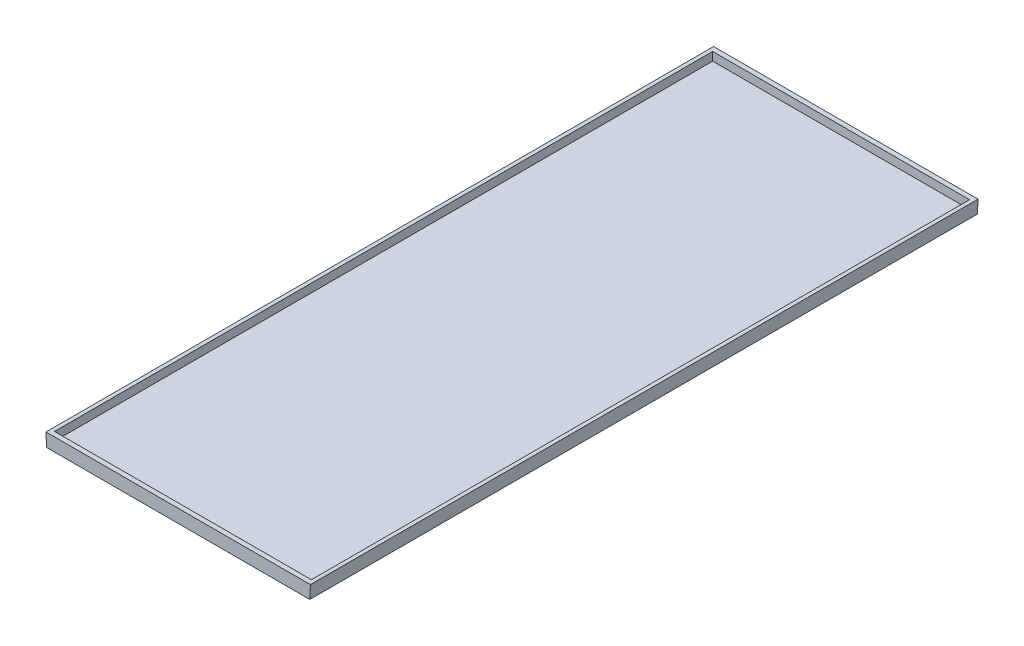
ISO-10303-21;
HEADER;
FILE_DESCRIPTION(('STEP AP214'),'2;1');
FILE_NAME('part.step','',(''),(''),'','','');
FILE_SCHEMA(('AUTOMOTIVE_DESIGN { 1 0 10303 214 1 1 1 1 }'));
ENDSEC;
DATA;
#1=APPLICATION_CONTEXT('core data for automotive mechanical design processes');
#2=APPLICATION_PROTOCOL_DEFINITION('international standard','automotive_design',2000,#1);
#3=PRODUCT_CONTEXT('',#1,'mechanical');
#4=PRODUCT('Part','Part','',(#3));
#5=PRODUCT_RELATED_PRODUCT_CATEGORY('part','',(#4));
#6=PRODUCT_DEFINITION_FORMATION('','',#4);
#7=PRODUCT_DEFINITION_CONTEXT('part definition',#1,'design');
#8=PRODUCT_DEFINITION('design','',#6,#7);
#9=PRODUCT_DEFINITION_SHAPE('','',#8);
#10=(LENGTH_UNIT() NAMED_UNIT(*) SI_UNIT(.MILLI.,.METRE.));
#11=(NAMED_UNIT(*) PLANE_ANGLE_UNIT() SI_UNIT($,.RADIAN.));
#12=(NAMED_UNIT(*) SI_UNIT($,.STERADIAN.) SOLID_ANGLE_UNIT());
#13=UNCERTAINTY_MEASURE_WITH_UNIT(LENGTH_MEASURE(1.E-05),#10,'distance_accuracy_value','');
#14=(GEOMETRIC_REPRESENTATION_CONTEXT(3) GLOBAL_UNCERTAINTY_ASSIGNED_CONTEXT((#13)) GLOBAL_UNIT_ASSIGNED_CONTEXT((#10,
#11,#12)) REPRESENTATION_CONTEXT('',''));
#15=CARTESIAN_POINT('',(0.,0.,0.));
#16=DIRECTION('',(0.,0.,1.));
#17=DIRECTION('',(1.,0.,0.));
#18=AXIS2_PLACEMENT_3D('',#15,#16,#17);
#19=CARTESIAN_POINT('',(-70.,-7.00000000000001,355.));
#20=DIRECTION('',(0.99908289581767,0.042817838392185,0.));
#21=DIRECTION('',(-0.042817838392185,0.99908289581767,0.));
#22=AXIS2_PLACEMENT_3D('',#19,#20,#21);
#23=PLANE('',#22);
#24=DIRECTION('',(0.042817838392185,-0.99908289581767,0.));
#25=VECTOR('',#24,1.);
#26=CARTESIAN_POINT('',(-70.,-7.00000000000001,0.));
#27=LINE('',#26,#25);
#28=CARTESIAN_POINT('',(-70.3,0.,0.));
#29=VERTEX_POINT('',#28);
#30=CARTESIAN_POINT('',(-70.,-7.00000000000001,0.));
#31=VERTEX_POINT('',#30);
#32=EDGE_CURVE('E148',#29,#31,#27,.T.);
#33=ORIENTED_EDGE('',*,*,#32,.T.);
#34=DIRECTION('',(0.,0.,-1.));
#35=VECTOR('',#34,1.);
#36=CARTESIAN_POINT('',(-70.,-7.00000000000001,355.));
#37=LINE('',#36,#35);
#38=CARTESIAN_POINT('',(-70.,-7.00000000000001,355.));
#39=VERTEX_POINT('',#38);
#40=EDGE_CURVE('E11',#39,#31,#37,.T.);
#41=ORIENTED_EDGE('',*,*,#40,.F.);
#42=DIRECTION('',(0.042817838392185,-0.99908289581767,0.));
#43=VECTOR('',#42,1.);
#44=CARTESIAN_POINT('',(-70.,-7.00000000000001,355.));
#45=LINE('',#44,#43);
#46=CARTESIAN_POINT('',(-70.3,0.,355.));
#47=VERTEX_POINT('',#46);
#48=EDGE_CURVE('E152',#47,#39,#45,.T.);
#49=ORIENTED_EDGE('',*,*,#48,.F.);
#50=DIRECTION('',(0.,0.,-1.));
#51=VECTOR('',#50,1.);
#52=CARTESIAN_POINT('',(-70.3,0.,355.));
#53=LINE('',#52,#51);
#54=EDGE_CURVE('E158',#47,#29,#53,.T.);
#55=ORIENTED_EDGE('',*,*,#54,.T.);
#56=EDGE_LOOP('',(#33,#41,#49,#55));
#57=FACE_BOUND('',#56,.T.);
#58=ADVANCED_FACE('F41',(#57),#23,.F.);
#59=CARTESIAN_POINT('',(-70.,-7.00000000000001,355.));
#60=DIRECTION('',(0.,1.,0.));
#61=DIRECTION('',(0.,0.,1.));
#62=AXIS2_PLACEMENT_3D('',#59,#60,#61);
#63=PLANE('',#62);
#64=DIRECTION('',(1.,0.,0.));
#65=VECTOR('',#64,1.);
#66=CARTESIAN_POINT('',(-70.,-7.00000000000001,0.));
#67=LINE('',#66,#65);
#68=CARTESIAN_POINT('',(70.,-7.00000000000001,0.));
#69=VERTEX_POINT('',#68);
#70=EDGE_CURVE('E161',#31,#69,#67,.T.);
#71=ORIENTED_EDGE('',*,*,#70,.T.);
#72=DIRECTION('',(0.,0.,-1.));
#73=VECTOR('',#72,1.);
#74=CARTESIAN_POINT('',(70.,-7.00000000000001,355.));
#75=LINE('',#74,#73);
#76=CARTESIAN_POINT('',(70.,-7.00000000000001,355.));
#77=VERTEX_POINT('',#76);
#78=EDGE_CURVE('E48',#77,#69,#75,.T.);
#79=ORIENTED_EDGE('',*,*,#78,.F.);
#80=DIRECTION('',(1.,0.,0.));
#81=VECTOR('',#80,1.);
#82=CARTESIAN_POINT('',(-70.,-7.00000000000001,355.));
#83=LINE('',#82,#81);
#84=EDGE_CURVE('E92',#39,#77,#83,.T.);
#85=ORIENTED_EDGE('',*,*,#84,.F.);
#86=ORIENTED_EDGE('',*,*,#40,.T.);
#87=EDGE_LOOP('',(#71,#79,#85,#86));
#88=FACE_BOUND('',#87,.T.);
#89=ADVANCED_FACE('F190',(#88),#63,.F.);
#90=CARTESIAN_POINT('',(70.,-7.00000000000001,355.));
#91=DIRECTION('',(-0.99908289581767,0.042817838392185,0.));
#92=DIRECTION('',(-0.042817838392185,-0.99908289581767,0.));
#93=AXIS2_PLACEMENT_3D('',#90,#91,#92);
#94=PLANE('',#93);
#95=DIRECTION('',(0.042817838392185,0.99908289581767,0.));
#96=VECTOR('',#95,1.);
#97=CARTESIAN_POINT('',(70.,-7.00000000000001,0.));
#98=LINE('',#97,#96);
#99=CARTESIAN_POINT('',(70.3,0.,0.));
#100=VERTEX_POINT('',#99);
#101=EDGE_CURVE('E163',#69,#100,#98,.T.);
#102=ORIENTED_EDGE('',*,*,#101,.T.);
#103=DIRECTION('',(0.,0.,-1.));
#104=VECTOR('',#103,1.);
#105=CARTESIAN_POINT('',(70.3,0.,355.));
#106=LINE('',#105,#104);
#107=CARTESIAN_POINT('',(70.3,0.,355.));
#108=VERTEX_POINT('',#107);
#109=EDGE_CURVE('E167',#108,#100,#106,.T.);
#110=ORIENTED_EDGE('',*,*,#109,.F.);
#111=DIRECTION('',(0.042817838392185,0.99908289581767,0.));
#112=VECTOR('',#111,1.);
#113=CARTESIAN_POINT('',(70.,-7.00000000000001,355.));
#114=LINE('',#113,#112);
#115=EDGE_CURVE('E155',#77,#108,#114,.T.);
#116=ORIENTED_EDGE('',*,*,#115,.F.);
#117=ORIENTED_EDGE('',*,*,#78,.T.);
#118=EDGE_LOOP('',(#102,#110,#116,#117));
#119=FACE_BOUND('',#118,.T.);
#120=ADVANCED_FACE('F172',(#119),#94,.F.);
#121=CARTESIAN_POINT('',(70.3,0.,355.));
#122=DIRECTION('',(0.,-1.,0.));
#123=DIRECTION('',(0.,0.,-1.));
#124=AXIS2_PLACEMENT_3D('',#121,#122,#123);
#125=PLANE('',#124);
#126=DIRECTION('',(0.,0.,-1.));
#127=VECTOR('',#126,1.);
#128=CARTESIAN_POINT('',(68.3,0.,0.));
#129=LINE('',#128,#127);
#130=CARTESIAN_POINT('',(68.3,0.,352.5));
#131=VERTEX_POINT('',#130);
#132=CARTESIAN_POINT('',(68.3,0.,2.5));
#133=VERTEX_POINT('',#132);
#134=EDGE_CURVE('E142',#131,#133,#129,.T.);
#135=ORIENTED_EDGE('',*,*,#134,.F.);
#136=DIRECTION('',(1.,0.,0.));
#137=VECTOR('',#136,1.);
#138=CARTESIAN_POINT('',(0.,0.,352.5));
#139=LINE('',#138,#137);
#140=CARTESIAN_POINT('',(-68.3,0.,352.5));
#141=VERTEX_POINT('',#140);
#142=EDGE_CURVE('E55',#141,#131,#139,.T.);
#143=ORIENTED_EDGE('',*,*,#142,.F.);
#144=DIRECTION('',(0.,0.,-1.));
#145=VECTOR('',#144,1.);
#146=CARTESIAN_POINT('',(-68.3,0.,0.));
#147=LINE('',#146,#145);
#148=CARTESIAN_POINT('',(-68.3,0.,2.5));
#149=VERTEX_POINT('',#148);
#150=EDGE_CURVE('E133',#141,#149,#147,.T.);
#151=ORIENTED_EDGE('',*,*,#150,.T.);
#152=DIRECTION('',(1.,0.,0.));
#153=VECTOR('',#152,1.);
#154=CARTESIAN_POINT('',(0.,0.,2.5));
#155=LINE('',#154,#153);
#156=EDGE_CURVE('E136',#149,#133,#155,.T.);
#157=ORIENTED_EDGE('',*,*,#156,.T.);
#158=EDGE_LOOP('',(#135,#143,#151,#157));
#159=FACE_BOUND('',#158,.T.);
#160=DIRECTION('',(-1.,0.,0.));
#161=VECTOR('',#160,1.);
#162=CARTESIAN_POINT('',(70.3,0.,0.));
#163=LINE('',#162,#161);
#164=EDGE_CURVE('E85',#100,#29,#163,.T.);
#165=ORIENTED_EDGE('',*,*,#164,.T.);
#166=ORIENTED_EDGE('',*,*,#54,.F.);
#167=DIRECTION('',(-1.,0.,0.));
#168=VECTOR('',#167,1.);
#169=CARTESIAN_POINT('',(70.3,0.,355.));
#170=LINE('',#169,#168);
#171=EDGE_CURVE('E64',#108,#47,#170,.T.);
#172=ORIENTED_EDGE('',*,*,#171,.F.);
#173=ORIENTED_EDGE('',*,*,#109,.T.);
#174=EDGE_LOOP('',(#165,#166,#172,#173));
#175=FACE_BOUND('',#174,.T.);
#176=ADVANCED_FACE('F180',(#159,#175),#125,.F.);
#177=CARTESIAN_POINT('',(0.,0.,355.));
#178=DIRECTION('',(0.,0.,1.));
#179=DIRECTION('',(1.,0.,0.));
#180=AXIS2_PLACEMENT_3D('',#177,#178,#179);
#181=PLANE('',#180);
#182=ORIENTED_EDGE('',*,*,#48,.T.);
#183=ORIENTED_EDGE('',*,*,#84,.T.);
#184=ORIENTED_EDGE('',*,*,#115,.T.);
#185=ORIENTED_EDGE('',*,*,#171,.T.);
#186=EDGE_LOOP('',(#182,#183,#184,#185));
#187=FACE_BOUND('',#186,.T.);
#188=ADVANCED_FACE('F182',(#187),#181,.T.);
#189=CARTESIAN_POINT('',(0.,0.,0.));
#190=DIRECTION('',(0.,0.,1.));
#191=DIRECTION('',(1.,0.,0.));
#192=AXIS2_PLACEMENT_3D('',#189,#190,#191);
#193=PLANE('',#192);
#194=ORIENTED_EDGE('',*,*,#32,.F.);
#195=ORIENTED_EDGE('',*,*,#164,.F.);
#196=ORIENTED_EDGE('',*,*,#101,.F.);
#197=ORIENTED_EDGE('',*,*,#70,.F.);
#198=EDGE_LOOP('',(#194,#195,#196,#197));
#199=FACE_BOUND('',#198,.T.);
#200=ADVANCED_FACE('F176',(#199),#193,.F.);
#201=CARTESIAN_POINT('',(0.,-4.5,352.5));
#202=DIRECTION('',(0.,0.,1.));
#203=DIRECTION('',(1.,0.,0.));
#204=AXIS2_PLACEMENT_3D('',#201,#202,#203);
#205=PLANE('',#204);
#206=ORIENTED_EDGE('',*,*,#142,.T.);
#207=DIRECTION('',(0.,1.,0.));
#208=VECTOR('',#207,1.);
#209=CARTESIAN_POINT('',(68.3,-4.5,352.5));
#210=LINE('',#209,#208);
#211=CARTESIAN_POINT('',(68.3,-4.5,352.5));
#212=VERTEX_POINT('',#211);
#213=EDGE_CURVE('E112',#212,#131,#210,.T.);
#214=ORIENTED_EDGE('',*,*,#213,.F.);
#215=DIRECTION('',(1.,0.,0.));
#216=VECTOR('',#215,1.);
#217=CARTESIAN_POINT('',(0.,-4.5,352.5));
#218=LINE('',#217,#216);
#219=CARTESIAN_POINT('',(-68.3,-4.5,352.5));
#220=VERTEX_POINT('',#219);
#221=EDGE_CURVE('E116',#220,#212,#218,.T.);
#222=ORIENTED_EDGE('',*,*,#221,.F.);
#223=DIRECTION('',(0.,1.,0.));
#224=VECTOR('',#223,1.);
#225=CARTESIAN_POINT('',(-68.3,-4.5,352.5));
#226=LINE('',#225,#224);
#227=EDGE_CURVE('E146',#220,#141,#226,.T.);
#228=ORIENTED_EDGE('',*,*,#227,.T.);
#229=EDGE_LOOP('',(#206,#214,#222,#228));
#230=FACE_BOUND('',#229,.T.);
#231=ADVANCED_FACE('F114',(#230),#205,.F.);
#232=CARTESIAN_POINT('',(-68.3,-4.5,0.));
#233=DIRECTION('',(1.,0.,0.));
#234=DIRECTION('',(0.,0.,-1.));
#235=AXIS2_PLACEMENT_3D('',#232,#233,#234);
#236=PLANE('',#235);
#237=ORIENTED_EDGE('',*,*,#150,.F.);
#238=ORIENTED_EDGE('',*,*,#227,.F.);
#239=DIRECTION('',(0.,0.,-1.));
#240=VECTOR('',#239,1.);
#241=CARTESIAN_POINT('',(-68.3,-4.5,0.));
#242=LINE('',#241,#240);
#243=CARTESIAN_POINT('',(-68.3,-4.5,2.5));
#244=VERTEX_POINT('',#243);
#245=EDGE_CURVE('E121',#220,#244,#242,.T.);
#246=ORIENTED_EDGE('',*,*,#245,.T.);
#247=DIRECTION('',(0.,1.,0.));
#248=VECTOR('',#247,1.);
#249=CARTESIAN_POINT('',(-68.3,-4.5,2.5));
#250=LINE('',#249,#248);
#251=EDGE_CURVE('E149',#244,#149,#250,.T.);
#252=ORIENTED_EDGE('',*,*,#251,.T.);
#253=EDGE_LOOP('',(#237,#238,#246,#252));
#254=FACE_BOUND('',#253,.T.);
#255=ADVANCED_FACE('F233',(#254),#236,.T.);
#256=CARTESIAN_POINT('',(0.,-4.5,2.5));
#257=DIRECTION('',(0.,0.,1.));
#258=DIRECTION('',(1.,0.,0.));
#259=AXIS2_PLACEMENT_3D('',#256,#257,#258);
#260=PLANE('',#259);
#261=ORIENTED_EDGE('',*,*,#156,.F.);
#262=ORIENTED_EDGE('',*,*,#251,.F.);
#263=DIRECTION('',(1.,0.,0.));
#264=VECTOR('',#263,1.);
#265=CARTESIAN_POINT('',(0.,-4.5,2.5));
#266=LINE('',#265,#264);
#267=CARTESIAN_POINT('',(68.3,-4.5,2.5));
#268=VERTEX_POINT('',#267);
#269=EDGE_CURVE('E129',#244,#268,#266,.T.);
#270=ORIENTED_EDGE('',*,*,#269,.T.);
#271=DIRECTION('',(0.,1.,0.));
#272=VECTOR('',#271,1.);
#273=CARTESIAN_POINT('',(68.3,-4.5,2.5));
#274=LINE('',#273,#272);
#275=EDGE_CURVE('E120',#268,#133,#274,.T.);
#276=ORIENTED_EDGE('',*,*,#275,.T.);
#277=EDGE_LOOP('',(#261,#262,#270,#276));
#278=FACE_BOUND('',#277,.T.);
#279=ADVANCED_FACE('F243',(#278),#260,.T.);
#280=CARTESIAN_POINT('',(68.3,-4.5,0.));
#281=DIRECTION('',(1.,0.,0.));
#282=DIRECTION('',(0.,0.,-1.));
#283=AXIS2_PLACEMENT_3D('',#280,#281,#282);
#284=PLANE('',#283);
#285=ORIENTED_EDGE('',*,*,#134,.T.);
#286=ORIENTED_EDGE('',*,*,#275,.F.);
#287=DIRECTION('',(0.,0.,-1.));
#288=VECTOR('',#287,1.);
#289=CARTESIAN_POINT('',(68.3,-4.5,0.));
#290=LINE('',#289,#288);
#291=EDGE_CURVE('E125',#212,#268,#290,.T.);
#292=ORIENTED_EDGE('',*,*,#291,.F.);
#293=ORIENTED_EDGE('',*,*,#213,.T.);
#294=EDGE_LOOP('',(#285,#286,#292,#293));
#295=FACE_BOUND('',#294,.T.);
#296=ADVANCED_FACE('F126',(#295),#284,.F.);
#297=CARTESIAN_POINT('',(0.,-4.5,0.));
#298=DIRECTION('',(0.,1.,0.));
#299=DIRECTION('',(0.,0.,1.));
#300=AXIS2_PLACEMENT_3D('',#297,#298,#299);
#301=PLANE('',#300);
#302=ORIENTED_EDGE('',*,*,#221,.T.);
#303=ORIENTED_EDGE('',*,*,#291,.T.);
#304=ORIENTED_EDGE('',*,*,#269,.F.);
#305=ORIENTED_EDGE('',*,*,#245,.F.);
#306=EDGE_LOOP('',(#302,#303,#304,#305));
#307=FACE_BOUND('',#306,.T.);
#308=ADVANCED_FACE('F132',(#307),#301,.T.);
#309=CLOSED_SHELL('',(#58,#89,#120,#176,#188,#200,#231,#255,#279,#296,#308));
#310=MANIFOLD_SOLID_BREP('B2',#309);
#311=ADVANCED_BREP_SHAPE_REPRESENTATION('',(#18,#310),#14);
#312=SHAPE_DEFINITION_REPRESENTATION(#9,#311);
ENDSEC;
END-ISO-10303-21;
